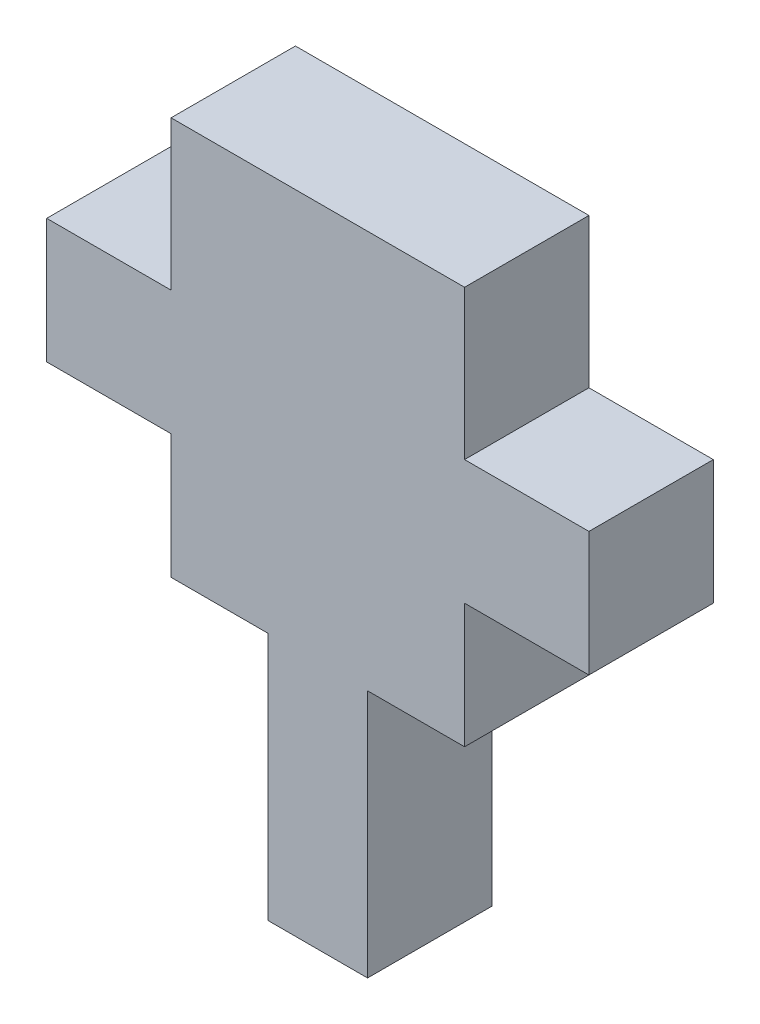
ISO-10303-21;
HEADER;
FILE_DESCRIPTION(('STEP AP214'),'2;1');
FILE_NAME('part.step','',(''),(''),'','','');
FILE_SCHEMA(('AUTOMOTIVE_DESIGN { 1 0 10303 214 1 1 1 1 }'));
ENDSEC;
DATA;
#1=APPLICATION_CONTEXT('core data for automotive mechanical design processes');
#2=APPLICATION_PROTOCOL_DEFINITION('international standard','automotive_design',2000,#1);
#3=PRODUCT_CONTEXT('',#1,'mechanical');
#4=PRODUCT('Part','Part','',(#3));
#5=PRODUCT_RELATED_PRODUCT_CATEGORY('part','',(#4));
#6=PRODUCT_DEFINITION_FORMATION('','',#4);
#7=PRODUCT_DEFINITION_CONTEXT('part definition',#1,'design');
#8=PRODUCT_DEFINITION('design','',#6,#7);
#9=PRODUCT_DEFINITION_SHAPE('','',#8);
#10=(LENGTH_UNIT() NAMED_UNIT(*) SI_UNIT(.MILLI.,.METRE.));
#11=(NAMED_UNIT(*) PLANE_ANGLE_UNIT() SI_UNIT($,.RADIAN.));
#12=(NAMED_UNIT(*) SI_UNIT($,.STERADIAN.) SOLID_ANGLE_UNIT());
#13=UNCERTAINTY_MEASURE_WITH_UNIT(LENGTH_MEASURE(1.E-05),#10,'distance_accuracy_value','');
#14=(GEOMETRIC_REPRESENTATION_CONTEXT(3) GLOBAL_UNCERTAINTY_ASSIGNED_CONTEXT((#13)) GLOBAL_UNIT_ASSIGNED_CONTEXT((#10,
#11,#12)) REPRESENTATION_CONTEXT('',''));
#15=CARTESIAN_POINT('',(0.,0.,0.));
#16=DIRECTION('',(0.,0.,1.));
#17=DIRECTION('',(1.,0.,0.));
#18=AXIS2_PLACEMENT_3D('',#15,#16,#17);
#19=CARTESIAN_POINT('',(7.9,0.,5.));
#20=DIRECTION('',(1.,0.,0.));
#21=DIRECTION('',(0.,0.,-1.));
#22=AXIS2_PLACEMENT_3D('',#19,#20,#21);
#23=PLANE('',#22);
#24=DIRECTION('',(0.,-1.,0.));
#25=VECTOR('',#24,1.);
#26=CARTESIAN_POINT('',(7.9,0.,0.));
#27=LINE('',#26,#25);
#28=CARTESIAN_POINT('',(7.9,0.,0.));
#29=VERTEX_POINT('',#28);
#30=CARTESIAN_POINT('',(7.9,-10.,0.));
#31=VERTEX_POINT('',#30);
#32=EDGE_CURVE('E178',#29,#31,#27,.T.);
#33=ORIENTED_EDGE('',*,*,#32,.F.);
#34=DIRECTION('',(0.,0.,-1.));
#35=VECTOR('',#34,1.);
#36=CARTESIAN_POINT('',(7.9,0.,5.));
#37=LINE('',#36,#35);
#38=CARTESIAN_POINT('',(7.9,0.,5.));
#39=VERTEX_POINT('',#38);
#40=EDGE_CURVE('E11',#39,#29,#37,.T.);
#41=ORIENTED_EDGE('',*,*,#40,.F.);
#42=DIRECTION('',(0.,-1.,0.));
#43=VECTOR('',#42,1.);
#44=CARTESIAN_POINT('',(7.9,0.,5.));
#45=LINE('',#44,#43);
#46=CARTESIAN_POINT('',(7.9,-10.,5.));
#47=VERTEX_POINT('',#46);
#48=EDGE_CURVE('E212',#39,#47,#45,.T.);
#49=ORIENTED_EDGE('',*,*,#48,.T.);
#50=DIRECTION('',(0.,0.,-1.));
#51=VECTOR('',#50,1.);
#52=CARTESIAN_POINT('',(7.9,-10.,5.));
#53=LINE('',#52,#51);
#54=EDGE_CURVE('E109',#47,#31,#53,.T.);
#55=ORIENTED_EDGE('',*,*,#54,.T.);
#56=EDGE_LOOP('',(#33,#41,#49,#55));
#57=FACE_BOUND('',#56,.T.);
#58=ADVANCED_FACE('F34',(#57),#23,.T.);
#59=CARTESIAN_POINT('',(0.,0.,5.));
#60=DIRECTION('',(0.,1.,0.));
#61=DIRECTION('',(0.,0.,1.));
#62=AXIS2_PLACEMENT_3D('',#59,#60,#61);
#63=PLANE('',#62);
#64=DIRECTION('',(1.,0.,0.));
#65=VECTOR('',#64,1.);
#66=CARTESIAN_POINT('',(0.,0.,0.));
#67=LINE('',#66,#65);
#68=CARTESIAN_POINT('',(11.8,0.,0.));
#69=VERTEX_POINT('',#68);
#70=EDGE_CURVE('E181',#29,#69,#67,.T.);
#71=ORIENTED_EDGE('',*,*,#70,.T.);
#72=DIRECTION('',(0.,0.,-1.));
#73=VECTOR('',#72,1.);
#74=CARTESIAN_POINT('',(11.8,0.,5.));
#75=LINE('',#74,#73);
#76=CARTESIAN_POINT('',(11.8,0.,5.));
#77=VERTEX_POINT('',#76);
#78=EDGE_CURVE('E42',#77,#69,#75,.T.);
#79=ORIENTED_EDGE('',*,*,#78,.F.);
#80=DIRECTION('',(1.,0.,0.));
#81=VECTOR('',#80,1.);
#82=CARTESIAN_POINT('',(0.,0.,5.));
#83=LINE('',#82,#81);
#84=EDGE_CURVE('E163',#39,#77,#83,.T.);
#85=ORIENTED_EDGE('',*,*,#84,.F.);
#86=ORIENTED_EDGE('',*,*,#40,.T.);
#87=EDGE_LOOP('',(#71,#79,#85,#86));
#88=FACE_BOUND('',#87,.T.);
#89=ADVANCED_FACE('F327',(#88),#63,.F.);
#90=CARTESIAN_POINT('',(11.8,0.,5.));
#91=DIRECTION('',(-1.,0.,0.));
#92=DIRECTION('',(0.,0.,1.));
#93=AXIS2_PLACEMENT_3D('',#90,#91,#92);
#94=PLANE('',#93);
#95=DIRECTION('',(0.,1.,0.));
#96=VECTOR('',#95,1.);
#97=CARTESIAN_POINT('',(11.8,0.,0.));
#98=LINE('',#97,#96);
#99=CARTESIAN_POINT('',(11.8,5.,0.));
#100=VERTEX_POINT('',#99);
#101=EDGE_CURVE('E183',#69,#100,#98,.T.);
#102=ORIENTED_EDGE('',*,*,#101,.T.);
#103=DIRECTION('',(0.,0.,-1.));
#104=VECTOR('',#103,1.);
#105=CARTESIAN_POINT('',(11.8,5.,5.));
#106=LINE('',#105,#104);
#107=CARTESIAN_POINT('',(11.8,5.,5.));
#108=VERTEX_POINT('',#107);
#109=EDGE_CURVE('E236',#108,#100,#106,.T.);
#110=ORIENTED_EDGE('',*,*,#109,.F.);
#111=DIRECTION('',(0.,1.,0.));
#112=VECTOR('',#111,1.);
#113=CARTESIAN_POINT('',(11.8,0.,5.));
#114=LINE('',#113,#112);
#115=EDGE_CURVE('E245',#77,#108,#114,.T.);
#116=ORIENTED_EDGE('',*,*,#115,.F.);
#117=ORIENTED_EDGE('',*,*,#78,.T.);
#118=EDGE_LOOP('',(#102,#110,#116,#117));
#119=FACE_BOUND('',#118,.T.);
#120=ADVANCED_FACE('F243',(#119),#94,.F.);
#121=CARTESIAN_POINT('',(0.,5.,5.));
#122=DIRECTION('',(0.,1.,0.));
#123=DIRECTION('',(0.,0.,1.));
#124=AXIS2_PLACEMENT_3D('',#121,#122,#123);
#125=PLANE('',#124);
#126=DIRECTION('',(1.,0.,0.));
#127=VECTOR('',#126,1.);
#128=CARTESIAN_POINT('',(0.,5.,0.));
#129=LINE('',#128,#127);
#130=CARTESIAN_POINT('',(16.8,5.,0.));
#131=VERTEX_POINT('',#130);
#132=EDGE_CURVE('E185',#100,#131,#129,.T.);
#133=ORIENTED_EDGE('',*,*,#132,.T.);
#134=DIRECTION('',(0.,0.,-1.));
#135=VECTOR('',#134,1.);
#136=CARTESIAN_POINT('',(16.8,5.,5.));
#137=LINE('',#136,#135);
#138=CARTESIAN_POINT('',(16.8,5.,5.));
#139=VERTEX_POINT('',#138);
#140=EDGE_CURVE('E233',#139,#131,#137,.T.);
#141=ORIENTED_EDGE('',*,*,#140,.F.);
#142=DIRECTION('',(1.,0.,0.));
#143=VECTOR('',#142,1.);
#144=CARTESIAN_POINT('',(0.,5.,5.));
#145=LINE('',#144,#143);
#146=EDGE_CURVE('E264',#108,#139,#145,.T.);
#147=ORIENTED_EDGE('',*,*,#146,.F.);
#148=ORIENTED_EDGE('',*,*,#109,.T.);
#149=EDGE_LOOP('',(#133,#141,#147,#148));
#150=FACE_BOUND('',#149,.T.);
#151=ADVANCED_FACE('F254',(#150),#125,.F.);
#152=CARTESIAN_POINT('',(16.8,0.,5.));
#153=DIRECTION('',(-1.,0.,0.));
#154=DIRECTION('',(0.,0.,1.));
#155=AXIS2_PLACEMENT_3D('',#152,#153,#154);
#156=PLANE('',#155);
#157=DIRECTION('',(0.,1.,0.));
#158=VECTOR('',#157,1.);
#159=CARTESIAN_POINT('',(16.8,0.,0.));
#160=LINE('',#159,#158);
#161=CARTESIAN_POINT('',(16.8,10.,0.));
#162=VERTEX_POINT('',#161);
#163=EDGE_CURVE('E188',#131,#162,#160,.T.);
#164=ORIENTED_EDGE('',*,*,#163,.T.);
#165=DIRECTION('',(0.,0.,-1.));
#166=VECTOR('',#165,1.);
#167=CARTESIAN_POINT('',(16.8,10.,5.));
#168=LINE('',#167,#166);
#169=CARTESIAN_POINT('',(16.8,10.,5.));
#170=VERTEX_POINT('',#169);
#171=EDGE_CURVE('E231',#170,#162,#168,.T.);
#172=ORIENTED_EDGE('',*,*,#171,.F.);
#173=DIRECTION('',(0.,1.,0.));
#174=VECTOR('',#173,1.);
#175=CARTESIAN_POINT('',(16.8,0.,5.));
#176=LINE('',#175,#174);
#177=EDGE_CURVE('E260',#139,#170,#176,.T.);
#178=ORIENTED_EDGE('',*,*,#177,.F.);
#179=ORIENTED_EDGE('',*,*,#140,.T.);
#180=EDGE_LOOP('',(#164,#172,#178,#179));
#181=FACE_BOUND('',#180,.T.);
#182=ADVANCED_FACE('F258',(#181),#156,.F.);
#183=CARTESIAN_POINT('',(0.,10.,5.));
#184=DIRECTION('',(0.,1.,0.));
#185=DIRECTION('',(0.,0.,1.));
#186=AXIS2_PLACEMENT_3D('',#183,#184,#185);
#187=PLANE('',#186);
#188=DIRECTION('',(1.,0.,0.));
#189=VECTOR('',#188,1.);
#190=CARTESIAN_POINT('',(0.,10.,0.));
#191=LINE('',#190,#189);
#192=CARTESIAN_POINT('',(11.8,10.,0.));
#193=VERTEX_POINT('',#192);
#194=EDGE_CURVE('E191',#193,#162,#191,.T.);
#195=ORIENTED_EDGE('',*,*,#194,.F.);
#196=DIRECTION('',(0.,0.,-1.));
#197=VECTOR('',#196,1.);
#198=CARTESIAN_POINT('',(11.8,10.,5.));
#199=LINE('',#198,#197);
#200=CARTESIAN_POINT('',(11.8,10.,5.));
#201=VERTEX_POINT('',#200);
#202=EDGE_CURVE('E229',#201,#193,#199,.T.);
#203=ORIENTED_EDGE('',*,*,#202,.F.);
#204=DIRECTION('',(1.,0.,0.));
#205=VECTOR('',#204,1.);
#206=CARTESIAN_POINT('',(0.,10.,5.));
#207=LINE('',#206,#205);
#208=EDGE_CURVE('E263',#201,#170,#207,.T.);
#209=ORIENTED_EDGE('',*,*,#208,.T.);
#210=ORIENTED_EDGE('',*,*,#171,.T.);
#211=EDGE_LOOP('',(#195,#203,#209,#210));
#212=FACE_BOUND('',#211,.T.);
#213=ADVANCED_FACE('F317',(#212),#187,.T.);
#214=CARTESIAN_POINT('',(11.8,16.,0.));
#215=VERTEX_POINT('',#214);
#216=EDGE_CURVE('E186',#193,#215,#98,.T.);
#217=ORIENTED_EDGE('',*,*,#216,.T.);
#218=DIRECTION('',(0.,0.,-1.));
#219=VECTOR('',#218,1.);
#220=CARTESIAN_POINT('',(11.8,16.,5.));
#221=LINE('',#220,#219);
#222=CARTESIAN_POINT('',(11.8,16.,5.));
#223=VERTEX_POINT('',#222);
#224=EDGE_CURVE('E227',#223,#215,#221,.T.);
#225=ORIENTED_EDGE('',*,*,#224,.F.);
#226=EDGE_CURVE('E266',#201,#223,#114,.T.);
#227=ORIENTED_EDGE('',*,*,#226,.F.);
#228=ORIENTED_EDGE('',*,*,#202,.T.);
#229=EDGE_LOOP('',(#217,#225,#227,#228));
#230=FACE_BOUND('',#229,.T.);
#231=ADVANCED_FACE('F298',(#230),#94,.F.);
#232=CARTESIAN_POINT('',(0.,16.,5.));
#233=DIRECTION('',(0.,1.,0.));
#234=DIRECTION('',(0.,0.,1.));
#235=AXIS2_PLACEMENT_3D('',#232,#233,#234);
#236=PLANE('',#235);
#237=DIRECTION('',(1.,0.,0.));
#238=VECTOR('',#237,1.);
#239=CARTESIAN_POINT('',(0.,16.,0.));
#240=LINE('',#239,#238);
#241=CARTESIAN_POINT('',(0.,16.,0.));
#242=VERTEX_POINT('',#241);
#243=EDGE_CURVE('E194',#242,#215,#240,.T.);
#244=ORIENTED_EDGE('',*,*,#243,.F.);
#245=DIRECTION('',(0.,0.,-1.));
#246=VECTOR('',#245,1.);
#247=CARTESIAN_POINT('',(0.,16.,5.));
#248=LINE('',#247,#246);
#249=CARTESIAN_POINT('',(0.,16.,5.));
#250=VERTEX_POINT('',#249);
#251=EDGE_CURVE('E225',#250,#242,#248,.T.);
#252=ORIENTED_EDGE('',*,*,#251,.F.);
#253=DIRECTION('',(1.,0.,0.));
#254=VECTOR('',#253,1.);
#255=CARTESIAN_POINT('',(0.,16.,5.));
#256=LINE('',#255,#254);
#257=EDGE_CURVE('E271',#250,#223,#256,.T.);
#258=ORIENTED_EDGE('',*,*,#257,.T.);
#259=ORIENTED_EDGE('',*,*,#224,.T.);
#260=EDGE_LOOP('',(#244,#252,#258,#259));
#261=FACE_BOUND('',#260,.T.);
#262=ADVANCED_FACE('F302',(#261),#236,.T.);
#263=CARTESIAN_POINT('',(0.,0.,5.));
#264=DIRECTION('',(-1.,0.,0.));
#265=DIRECTION('',(0.,0.,1.));
#266=AXIS2_PLACEMENT_3D('',#263,#264,#265);
#267=PLANE('',#266);
#268=DIRECTION('',(0.,1.,0.));
#269=VECTOR('',#268,1.);
#270=CARTESIAN_POINT('',(0.,0.,0.));
#271=LINE('',#270,#269);
#272=CARTESIAN_POINT('',(0.,10.,0.));
#273=VERTEX_POINT('',#272);
#274=EDGE_CURVE('E197',#273,#242,#271,.T.);
#275=ORIENTED_EDGE('',*,*,#274,.F.);
#276=DIRECTION('',(0.,0.,-1.));
#277=VECTOR('',#276,1.);
#278=CARTESIAN_POINT('',(0.,10.,5.));
#279=LINE('',#278,#277);
#280=CARTESIAN_POINT('',(0.,10.,5.));
#281=VERTEX_POINT('',#280);
#282=EDGE_CURVE('E223',#281,#273,#279,.T.);
#283=ORIENTED_EDGE('',*,*,#282,.F.);
#284=DIRECTION('',(0.,1.,0.));
#285=VECTOR('',#284,1.);
#286=CARTESIAN_POINT('',(0.,0.,5.));
#287=LINE('',#286,#285);
#288=EDGE_CURVE('E274',#281,#250,#287,.T.);
#289=ORIENTED_EDGE('',*,*,#288,.T.);
#290=ORIENTED_EDGE('',*,*,#251,.T.);
#291=EDGE_LOOP('',(#275,#283,#289,#290));
#292=FACE_BOUND('',#291,.T.);
#293=ADVANCED_FACE('F305',(#292),#267,.T.);
#294=CARTESIAN_POINT('',(0.,10.,5.));
#295=DIRECTION('',(0.,-1.,0.));
#296=DIRECTION('',(0.,0.,-1.));
#297=AXIS2_PLACEMENT_3D('',#294,#295,#296);
#298=PLANE('',#297);
#299=DIRECTION('',(-1.,0.,0.));
#300=VECTOR('',#299,1.);
#301=CARTESIAN_POINT('',(0.,10.,0.));
#302=LINE('',#301,#300);
#303=CARTESIAN_POINT('',(-5.,10.,0.));
#304=VERTEX_POINT('',#303);
#305=EDGE_CURVE('E200',#273,#304,#302,.T.);
#306=ORIENTED_EDGE('',*,*,#305,.T.);
#307=DIRECTION('',(0.,0.,-1.));
#308=VECTOR('',#307,1.);
#309=CARTESIAN_POINT('',(-5.,10.,5.));
#310=LINE('',#309,#308);
#311=CARTESIAN_POINT('',(-5.,10.,5.));
#312=VERTEX_POINT('',#311);
#313=EDGE_CURVE('E220',#312,#304,#310,.T.);
#314=ORIENTED_EDGE('',*,*,#313,.F.);
#315=DIRECTION('',(-1.,0.,0.));
#316=VECTOR('',#315,1.);
#317=CARTESIAN_POINT('',(0.,10.,5.));
#318=LINE('',#317,#316);
#319=EDGE_CURVE('E277',#281,#312,#318,.T.);
#320=ORIENTED_EDGE('',*,*,#319,.F.);
#321=ORIENTED_EDGE('',*,*,#282,.T.);
#322=EDGE_LOOP('',(#306,#314,#320,#321));
#323=FACE_BOUND('',#322,.T.);
#324=ADVANCED_FACE('F309',(#323),#298,.F.);
#325=CARTESIAN_POINT('',(-5.,0.,5.));
#326=DIRECTION('',(1.,0.,0.));
#327=DIRECTION('',(0.,1.,0.));
#328=AXIS2_PLACEMENT_3D('',#325,#326,#327);
#329=PLANE('',#328);
#330=DIRECTION('',(0.,-1.,0.));
#331=VECTOR('',#330,1.);
#332=CARTESIAN_POINT('',(-5.,0.,0.));
#333=LINE('',#332,#331);
#334=CARTESIAN_POINT('',(-5.,5.,0.));
#335=VERTEX_POINT('',#334);
#336=EDGE_CURVE('E203',#304,#335,#333,.T.);
#337=ORIENTED_EDGE('',*,*,#336,.T.);
#338=DIRECTION('',(0.,0.,-1.));
#339=VECTOR('',#338,1.);
#340=CARTESIAN_POINT('',(-5.,5.,5.));
#341=LINE('',#340,#339);
#342=CARTESIAN_POINT('',(-5.,5.,5.));
#343=VERTEX_POINT('',#342);
#344=EDGE_CURVE('E218',#343,#335,#341,.T.);
#345=ORIENTED_EDGE('',*,*,#344,.F.);
#346=DIRECTION('',(0.,-1.,0.));
#347=VECTOR('',#346,1.);
#348=CARTESIAN_POINT('',(-5.,0.,5.));
#349=LINE('',#348,#347);
#350=EDGE_CURVE('E278',#312,#343,#349,.T.);
#351=ORIENTED_EDGE('',*,*,#350,.F.);
#352=ORIENTED_EDGE('',*,*,#313,.T.);
#353=EDGE_LOOP('',(#337,#345,#351,#352));
#354=FACE_BOUND('',#353,.T.);
#355=ADVANCED_FACE('F313',(#354),#329,.F.);
#356=CARTESIAN_POINT('',(0.,5.,5.));
#357=DIRECTION('',(0.,-1.,0.));
#358=DIRECTION('',(0.,0.,-1.));
#359=AXIS2_PLACEMENT_3D('',#356,#357,#358);
#360=PLANE('',#359);
#361=DIRECTION('',(-1.,0.,0.));
#362=VECTOR('',#361,1.);
#363=CARTESIAN_POINT('',(0.,5.,0.));
#364=LINE('',#363,#362);
#365=CARTESIAN_POINT('',(0.,5.,0.));
#366=VERTEX_POINT('',#365);
#367=EDGE_CURVE('E206',#366,#335,#364,.T.);
#368=ORIENTED_EDGE('',*,*,#367,.F.);
#369=DIRECTION('',(0.,0.,-1.));
#370=VECTOR('',#369,1.);
#371=CARTESIAN_POINT('',(0.,5.,5.));
#372=LINE('',#371,#370);
#373=CARTESIAN_POINT('',(0.,5.,5.));
#374=VERTEX_POINT('',#373);
#375=EDGE_CURVE('E216',#374,#366,#372,.T.);
#376=ORIENTED_EDGE('',*,*,#375,.F.);
#377=DIRECTION('',(-1.,0.,0.));
#378=VECTOR('',#377,1.);
#379=CARTESIAN_POINT('',(0.,5.,5.));
#380=LINE('',#379,#378);
#381=EDGE_CURVE('E175',#374,#343,#380,.T.);
#382=ORIENTED_EDGE('',*,*,#381,.T.);
#383=ORIENTED_EDGE('',*,*,#344,.T.);
#384=EDGE_LOOP('',(#368,#376,#382,#383));
#385=FACE_BOUND('',#384,.T.);
#386=ADVANCED_FACE('F314',(#385),#360,.T.);
#387=CARTESIAN_POINT('',(0.,0.,0.));
#388=VERTEX_POINT('',#387);
#389=EDGE_CURVE('E201',#388,#366,#271,.T.);
#390=ORIENTED_EDGE('',*,*,#389,.F.);
#391=DIRECTION('',(0.,0.,-1.));
#392=VECTOR('',#391,1.);
#393=CARTESIAN_POINT('',(0.,0.,5.));
#394=LINE('',#393,#392);
#395=CARTESIAN_POINT('',(0.,0.,5.));
#396=VERTEX_POINT('',#395);
#397=EDGE_CURVE('E168',#396,#388,#394,.T.);
#398=ORIENTED_EDGE('',*,*,#397,.F.);
#399=EDGE_CURVE('E160',#396,#374,#287,.T.);
#400=ORIENTED_EDGE('',*,*,#399,.T.);
#401=ORIENTED_EDGE('',*,*,#375,.T.);
#402=EDGE_LOOP('',(#390,#398,#400,#401));
#403=FACE_BOUND('',#402,.T.);
#404=ADVANCED_FACE('F285',(#403),#267,.T.);
#405=CARTESIAN_POINT('',(3.9,0.,0.));
#406=VERTEX_POINT('',#405);
#407=EDGE_CURVE('E167',#388,#406,#67,.T.);
#408=ORIENTED_EDGE('',*,*,#407,.T.);
#409=DIRECTION('',(0.,0.,-1.));
#410=VECTOR('',#409,1.);
#411=CARTESIAN_POINT('',(3.9,0.,5.));
#412=LINE('',#411,#410);
#413=CARTESIAN_POINT('',(3.9,0.,5.));
#414=VERTEX_POINT('',#413);
#415=EDGE_CURVE('E164',#414,#406,#412,.T.);
#416=ORIENTED_EDGE('',*,*,#415,.F.);
#417=EDGE_CURVE('E153',#396,#414,#83,.T.);
#418=ORIENTED_EDGE('',*,*,#417,.F.);
#419=ORIENTED_EDGE('',*,*,#397,.T.);
#420=EDGE_LOOP('',(#408,#416,#418,#419));
#421=FACE_BOUND('',#420,.T.);
#422=ADVANCED_FACE('F165',(#421),#63,.F.);
#423=CARTESIAN_POINT('',(3.9,0.,5.));
#424=DIRECTION('',(1.,0.,0.));
#425=DIRECTION('',(0.,1.,0.));
#426=AXIS2_PLACEMENT_3D('',#423,#424,#425);
#427=PLANE('',#426);
#428=DIRECTION('',(0.,-1.,0.));
#429=VECTOR('',#428,1.);
#430=CARTESIAN_POINT('',(3.9,0.,0.));
#431=LINE('',#430,#429);
#432=CARTESIAN_POINT('',(3.9,-10.,0.));
#433=VERTEX_POINT('',#432);
#434=EDGE_CURVE('E102',#406,#433,#431,.T.);
#435=ORIENTED_EDGE('',*,*,#434,.T.);
#436=DIRECTION('',(0.,0.,-1.));
#437=VECTOR('',#436,1.);
#438=CARTESIAN_POINT('',(3.9,-10.,5.));
#439=LINE('',#438,#437);
#440=CARTESIAN_POINT('',(3.9,-10.,5.));
#441=VERTEX_POINT('',#440);
#442=EDGE_CURVE('E169',#441,#433,#439,.T.);
#443=ORIENTED_EDGE('',*,*,#442,.F.);
#444=DIRECTION('',(0.,-1.,0.));
#445=VECTOR('',#444,1.);
#446=CARTESIAN_POINT('',(3.9,0.,5.));
#447=LINE('',#446,#445);
#448=EDGE_CURVE('E157',#414,#441,#447,.T.);
#449=ORIENTED_EDGE('',*,*,#448,.F.);
#450=ORIENTED_EDGE('',*,*,#415,.T.);
#451=EDGE_LOOP('',(#435,#443,#449,#450));
#452=FACE_BOUND('',#451,.T.);
#453=ADVANCED_FACE('F171',(#452),#427,.F.);
#454=CARTESIAN_POINT('',(0.,-10.,5.));
#455=DIRECTION('',(0.,1.,0.));
#456=DIRECTION('',(-1.,0.,0.));
#457=AXIS2_PLACEMENT_3D('',#454,#455,#456);
#458=PLANE('',#457);
#459=DIRECTION('',(1.,0.,0.));
#460=VECTOR('',#459,1.);
#461=CARTESIAN_POINT('',(0.,-10.,0.));
#462=LINE('',#461,#460);
#463=EDGE_CURVE('E210',#433,#31,#462,.T.);
#464=ORIENTED_EDGE('',*,*,#463,.T.);
#465=ORIENTED_EDGE('',*,*,#54,.F.);
#466=DIRECTION('',(1.,0.,0.));
#467=VECTOR('',#466,1.);
#468=CARTESIAN_POINT('',(0.,-10.,5.));
#469=LINE('',#468,#467);
#470=EDGE_CURVE('E50',#441,#47,#469,.T.);
#471=ORIENTED_EDGE('',*,*,#470,.F.);
#472=ORIENTED_EDGE('',*,*,#442,.T.);
#473=EDGE_LOOP('',(#464,#465,#471,#472));
#474=FACE_BOUND('',#473,.T.);
#475=ADVANCED_FACE('F290',(#474),#458,.F.);
#476=CARTESIAN_POINT('',(0.,0.,5.));
#477=DIRECTION('',(0.,0.,1.));
#478=DIRECTION('',(1.,0.,0.));
#479=AXIS2_PLACEMENT_3D('',#476,#477,#478);
#480=PLANE('',#479);
#481=ORIENTED_EDGE('',*,*,#48,.F.);
#482=ORIENTED_EDGE('',*,*,#84,.T.);
#483=ORIENTED_EDGE('',*,*,#115,.T.);
#484=ORIENTED_EDGE('',*,*,#146,.T.);
#485=ORIENTED_EDGE('',*,*,#177,.T.);
#486=ORIENTED_EDGE('',*,*,#208,.F.);
#487=ORIENTED_EDGE('',*,*,#226,.T.);
#488=ORIENTED_EDGE('',*,*,#257,.F.);
#489=ORIENTED_EDGE('',*,*,#288,.F.);
#490=ORIENTED_EDGE('',*,*,#319,.T.);
#491=ORIENTED_EDGE('',*,*,#350,.T.);
#492=ORIENTED_EDGE('',*,*,#381,.F.);
#493=ORIENTED_EDGE('',*,*,#399,.F.);
#494=ORIENTED_EDGE('',*,*,#417,.T.);
#495=ORIENTED_EDGE('',*,*,#448,.T.);
#496=ORIENTED_EDGE('',*,*,#470,.T.);
#497=EDGE_LOOP('',(#481,#482,#483,#484,#485,#486,#487,#488,#489,#490,#491,#492,#493,#494,#495,#496));
#498=FACE_BOUND('',#497,.T.);
#499=ADVANCED_FACE('F155',(#498),#480,.T.);
#500=CARTESIAN_POINT('',(0.,0.,0.));
#501=DIRECTION('',(0.,0.,1.));
#502=DIRECTION('',(1.,0.,0.));
#503=AXIS2_PLACEMENT_3D('',#500,#501,#502);
#504=PLANE('',#503);
#505=ORIENTED_EDGE('',*,*,#32,.T.);
#506=ORIENTED_EDGE('',*,*,#463,.F.);
#507=ORIENTED_EDGE('',*,*,#434,.F.);
#508=ORIENTED_EDGE('',*,*,#407,.F.);
#509=ORIENTED_EDGE('',*,*,#389,.T.);
#510=ORIENTED_EDGE('',*,*,#367,.T.);
#511=ORIENTED_EDGE('',*,*,#336,.F.);
#512=ORIENTED_EDGE('',*,*,#305,.F.);
#513=ORIENTED_EDGE('',*,*,#274,.T.);
#514=ORIENTED_EDGE('',*,*,#243,.T.);
#515=ORIENTED_EDGE('',*,*,#216,.F.);
#516=ORIENTED_EDGE('',*,*,#194,.T.);
#517=ORIENTED_EDGE('',*,*,#163,.F.);
#518=ORIENTED_EDGE('',*,*,#132,.F.);
#519=ORIENTED_EDGE('',*,*,#101,.F.);
#520=ORIENTED_EDGE('',*,*,#70,.F.);
#521=EDGE_LOOP('',(#505,#506,#507,#508,#509,#510,#511,#512,#513,#514,#515,#516,#517,#518,#519,#520));
#522=FACE_BOUND('',#521,.T.);
#523=ADVANCED_FACE('F250',(#522),#504,.F.);
#524=CLOSED_SHELL('',(#58,#89,#120,#151,#182,#213,#231,#262,#293,#324,#355,#386,#404,#422,#453,
#475,#499,#523));
#525=MANIFOLD_SOLID_BREP('B2',#524);
#526=ADVANCED_BREP_SHAPE_REPRESENTATION('',(#18,#525),#14);
#527=SHAPE_DEFINITION_REPRESENTATION(#9,#526);
ENDSEC;
END-ISO-10303-21;
